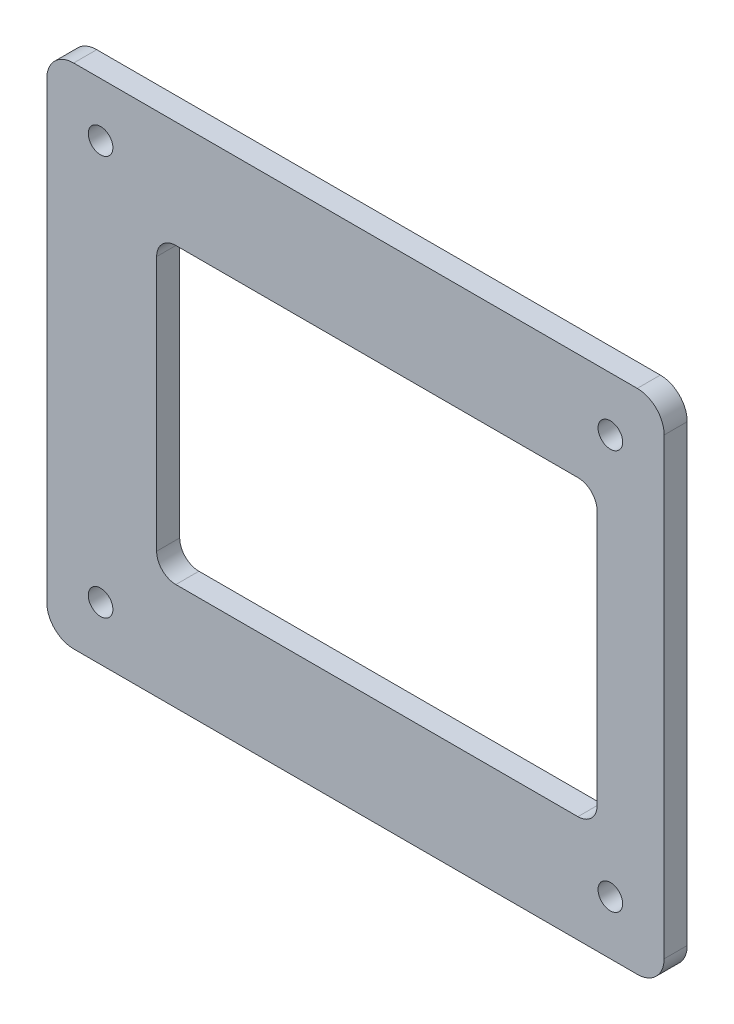
ISO-10303-21;
HEADER;
FILE_DESCRIPTION(('STEP AP214'),'2;1');
FILE_NAME('part.step','',(''),(''),'','','');
FILE_SCHEMA(('AUTOMOTIVE_DESIGN { 1 0 10303 214 1 1 1 1 }'));
ENDSEC;
DATA;
#1=APPLICATION_CONTEXT('core data for automotive mechanical design processes');
#2=APPLICATION_PROTOCOL_DEFINITION('international standard','automotive_design',2000,#1);
#3=PRODUCT_CONTEXT('',#1,'mechanical');
#4=PRODUCT('Part','Part','',(#3));
#5=PRODUCT_RELATED_PRODUCT_CATEGORY('part','',(#4));
#6=PRODUCT_DEFINITION_FORMATION('','',#4);
#7=PRODUCT_DEFINITION_CONTEXT('part definition',#1,'design');
#8=PRODUCT_DEFINITION('design','',#6,#7);
#9=PRODUCT_DEFINITION_SHAPE('','',#8);
#10=(LENGTH_UNIT() NAMED_UNIT(*) SI_UNIT(.MILLI.,.METRE.));
#11=(NAMED_UNIT(*) PLANE_ANGLE_UNIT() SI_UNIT($,.RADIAN.));
#12=(NAMED_UNIT(*) SI_UNIT($,.STERADIAN.) SOLID_ANGLE_UNIT());
#13=UNCERTAINTY_MEASURE_WITH_UNIT(LENGTH_MEASURE(1.E-05),#10,'distance_accuracy_value','');
#14=(GEOMETRIC_REPRESENTATION_CONTEXT(3) GLOBAL_UNCERTAINTY_ASSIGNED_CONTEXT((#13)) GLOBAL_UNIT_ASSIGNED_CONTEXT((#10,
#11,#12)) REPRESENTATION_CONTEXT('',''));
#15=CARTESIAN_POINT('',(0.,0.,0.));
#16=DIRECTION('',(0.,0.,1.));
#17=DIRECTION('',(1.,0.,0.));
#18=AXIS2_PLACEMENT_3D('',#15,#16,#17);
#19=CARTESIAN_POINT('',(0.,0.,3.));
#20=DIRECTION('',(1.,0.,0.));
#21=DIRECTION('',(0.,0.,-1.));
#22=AXIS2_PLACEMENT_3D('',#19,#20,#21);
#23=PLANE('',#22);
#24=DIRECTION('',(0.,-1.,0.));
#25=VECTOR('',#24,1.);
#26=CARTESIAN_POINT('',(0.,0.,0.));
#27=LINE('',#26,#25);
#28=CARTESIAN_POINT('',(0.,62.5,0.));
#29=VERTEX_POINT('',#28);
#30=CARTESIAN_POINT('',(0.,3.5,0.));
#31=VERTEX_POINT('',#30);
#32=EDGE_CURVE('E174',#29,#31,#27,.T.);
#33=ORIENTED_EDGE('',*,*,#32,.T.);
#34=DIRECTION('',(0.,0.,-1.));
#35=VECTOR('',#34,1.);
#36=CARTESIAN_POINT('',(0.,3.5,3.));
#37=LINE('',#36,#35);
#38=CARTESIAN_POINT('',(0.,3.5,3.));
#39=VERTEX_POINT('',#38);
#40=EDGE_CURVE('E152',#31,#39,#37,.F.);
#41=ORIENTED_EDGE('',*,*,#40,.T.);
#42=DIRECTION('',(0.,-1.,0.));
#43=VECTOR('',#42,1.);
#44=CARTESIAN_POINT('',(0.,0.,3.));
#45=LINE('',#44,#43);
#46=CARTESIAN_POINT('',(0.,62.5,3.));
#47=VERTEX_POINT('',#46);
#48=EDGE_CURVE('E185',#47,#39,#45,.T.);
#49=ORIENTED_EDGE('',*,*,#48,.F.);
#50=DIRECTION('',(0.,0.,-1.));
#51=VECTOR('',#50,1.);
#52=CARTESIAN_POINT('',(0.,62.5,3.));
#53=LINE('',#52,#51);
#54=EDGE_CURVE('E157',#47,#29,#53,.T.);
#55=ORIENTED_EDGE('',*,*,#54,.T.);
#56=EDGE_LOOP('',(#33,#41,#49,#55));
#57=FACE_BOUND('',#56,.T.);
#58=ADVANCED_FACE('F33',(#57),#23,.F.);
#59=CARTESIAN_POINT('',(0.,0.,3.));
#60=DIRECTION('',(0.,1.,0.));
#61=DIRECTION('',(0.,0.,1.));
#62=AXIS2_PLACEMENT_3D('',#59,#60,#61);
#63=PLANE('',#62);
#64=DIRECTION('',(1.,0.,0.));
#65=VECTOR('',#64,1.);
#66=CARTESIAN_POINT('',(0.,0.,3.));
#67=LINE('',#66,#65);
#68=CARTESIAN_POINT('',(3.5,0.,3.));
#69=VERTEX_POINT('',#68);
#70=CARTESIAN_POINT('',(76.8,0.,3.));
#71=VERTEX_POINT('',#70);
#72=EDGE_CURVE('E167',#69,#71,#67,.T.);
#73=ORIENTED_EDGE('',*,*,#72,.F.);
#74=DIRECTION('',(0.,0.,-1.));
#75=VECTOR('',#74,1.);
#76=CARTESIAN_POINT('',(3.5,0.,3.));
#77=LINE('',#76,#75);
#78=CARTESIAN_POINT('',(3.5,0.,0.));
#79=VERTEX_POINT('',#78);
#80=EDGE_CURVE('E151',#69,#79,#77,.T.);
#81=ORIENTED_EDGE('',*,*,#80,.T.);
#82=DIRECTION('',(1.,0.,0.));
#83=VECTOR('',#82,1.);
#84=CARTESIAN_POINT('',(0.,0.,0.));
#85=LINE('',#84,#83);
#86=CARTESIAN_POINT('',(76.8,0.,0.));
#87=VERTEX_POINT('',#86);
#88=EDGE_CURVE('E164',#79,#87,#85,.T.);
#89=ORIENTED_EDGE('',*,*,#88,.T.);
#90=DIRECTION('',(0.,0.,-1.));
#91=VECTOR('',#90,1.);
#92=CARTESIAN_POINT('',(76.8,0.,3.));
#93=LINE('',#92,#91);
#94=EDGE_CURVE('E169',#87,#71,#93,.F.);
#95=ORIENTED_EDGE('',*,*,#94,.T.);
#96=EDGE_LOOP('',(#73,#81,#89,#95));
#97=FACE_BOUND('',#96,.T.);
#98=ADVANCED_FACE('F163',(#97),#63,.F.);
#99=CARTESIAN_POINT('',(80.3,0.,3.));
#100=DIRECTION('',(-1.,0.,0.));
#101=DIRECTION('',(0.,0.,1.));
#102=AXIS2_PLACEMENT_3D('',#99,#100,#101);
#103=PLANE('',#102);
#104=DIRECTION('',(0.,1.,0.));
#105=VECTOR('',#104,1.);
#106=CARTESIAN_POINT('',(80.3,0.,3.));
#107=LINE('',#106,#105);
#108=CARTESIAN_POINT('',(80.3,3.5,3.));
#109=VERTEX_POINT('',#108);
#110=CARTESIAN_POINT('',(80.3,62.5,3.));
#111=VERTEX_POINT('',#110);
#112=EDGE_CURVE('E307',#109,#111,#107,.T.);
#113=ORIENTED_EDGE('',*,*,#112,.F.);
#114=DIRECTION('',(0.,0.,-1.));
#115=VECTOR('',#114,1.);
#116=CARTESIAN_POINT('',(80.3,3.5,3.));
#117=LINE('',#116,#115);
#118=CARTESIAN_POINT('',(80.3,3.5,0.));
#119=VERTEX_POINT('',#118);
#120=EDGE_CURVE('E205',#109,#119,#117,.T.);
#121=ORIENTED_EDGE('',*,*,#120,.T.);
#122=DIRECTION('',(0.,1.,0.));
#123=VECTOR('',#122,1.);
#124=CARTESIAN_POINT('',(80.3,0.,0.));
#125=LINE('',#124,#123);
#126=CARTESIAN_POINT('',(80.3,62.5,0.));
#127=VERTEX_POINT('',#126);
#128=EDGE_CURVE('E173',#119,#127,#125,.T.);
#129=ORIENTED_EDGE('',*,*,#128,.T.);
#130=DIRECTION('',(0.,0.,-1.));
#131=VECTOR('',#130,1.);
#132=CARTESIAN_POINT('',(80.3,62.5,3.));
#133=LINE('',#132,#131);
#134=EDGE_CURVE('E203',#127,#111,#133,.F.);
#135=ORIENTED_EDGE('',*,*,#134,.T.);
#136=EDGE_LOOP('',(#113,#121,#129,#135));
#137=FACE_BOUND('',#136,.T.);
#138=ADVANCED_FACE('F329',(#137),#103,.F.);
#139=CARTESIAN_POINT('',(0.,66.,3.));
#140=DIRECTION('',(0.,-1.,0.));
#141=DIRECTION('',(0.,0.,-1.));
#142=AXIS2_PLACEMENT_3D('',#139,#140,#141);
#143=PLANE('',#142);
#144=DIRECTION('',(-1.,0.,0.));
#145=VECTOR('',#144,1.);
#146=CARTESIAN_POINT('',(0.,66.,3.));
#147=LINE('',#146,#145);
#148=CARTESIAN_POINT('',(76.8,66.,3.));
#149=VERTEX_POINT('',#148);
#150=CARTESIAN_POINT('',(3.5,66.,3.));
#151=VERTEX_POINT('',#150);
#152=EDGE_CURVE('E186',#149,#151,#147,.T.);
#153=ORIENTED_EDGE('',*,*,#152,.F.);
#154=DIRECTION('',(0.,0.,-1.));
#155=VECTOR('',#154,1.);
#156=CARTESIAN_POINT('',(76.8,66.,3.));
#157=LINE('',#156,#155);
#158=CARTESIAN_POINT('',(76.8,66.,0.));
#159=VERTEX_POINT('',#158);
#160=EDGE_CURVE('E210',#149,#159,#157,.T.);
#161=ORIENTED_EDGE('',*,*,#160,.T.);
#162=DIRECTION('',(-1.,0.,0.));
#163=VECTOR('',#162,1.);
#164=CARTESIAN_POINT('',(0.,66.,0.));
#165=LINE('',#164,#163);
#166=CARTESIAN_POINT('',(3.5,66.,0.));
#167=VERTEX_POINT('',#166);
#168=EDGE_CURVE('E177',#159,#167,#165,.T.);
#169=ORIENTED_EDGE('',*,*,#168,.T.);
#170=DIRECTION('',(0.,0.,-1.));
#171=VECTOR('',#170,1.);
#172=CARTESIAN_POINT('',(3.5,66.,3.));
#173=LINE('',#172,#171);
#174=EDGE_CURVE('E208',#167,#151,#173,.F.);
#175=ORIENTED_EDGE('',*,*,#174,.T.);
#176=EDGE_LOOP('',(#153,#161,#169,#175));
#177=FACE_BOUND('',#176,.T.);
#178=ADVANCED_FACE('F323',(#177),#143,.F.);
#179=CARTESIAN_POINT('',(0.,0.,3.));
#180=DIRECTION('',(0.,0.,-1.));
#181=DIRECTION('',(-1.,0.,0.));
#182=AXIS2_PLACEMENT_3D('',#179,#180,#181);
#183=PLANE('',#182);
#184=DIRECTION('',(1.,0.,0.));
#185=VECTOR('',#184,1.);
#186=CARTESIAN_POINT('',(14.29,13.9,3.));
#187=LINE('',#186,#185);
#188=CARTESIAN_POINT('',(16.79,13.9,3.));
#189=VERTEX_POINT('',#188);
#190=CARTESIAN_POINT('',(69.08,13.9,3.));
#191=VERTEX_POINT('',#190);
#192=EDGE_CURVE('E277',#189,#191,#187,.T.);
#193=ORIENTED_EDGE('',*,*,#192,.F.);
#194=CARTESIAN_POINT('',(16.79,16.4,3.));
#195=DIRECTION('',(0.,0.,-1.));
#196=DIRECTION('',(-1.,0.,0.));
#197=AXIS2_PLACEMENT_3D('',#194,#195,#196);
#198=CIRCLE('',#197,2.5);
#199=CARTESIAN_POINT('',(14.29,16.4,3.));
#200=VERTEX_POINT('',#199);
#201=EDGE_CURVE('E232',#189,#200,#198,.T.);
#202=ORIENTED_EDGE('',*,*,#201,.T.);
#203=DIRECTION('',(0.,-1.,0.));
#204=VECTOR('',#203,1.);
#205=CARTESIAN_POINT('',(14.29,13.9,3.));
#206=LINE('',#205,#204);
#207=CARTESIAN_POINT('',(14.29,49.59,3.));
#208=VERTEX_POINT('',#207);
#209=EDGE_CURVE('E250',#208,#200,#206,.T.);
#210=ORIENTED_EDGE('',*,*,#209,.F.);
#211=CARTESIAN_POINT('',(16.79,49.59,3.));
#212=DIRECTION('',(0.,0.,-1.));
#213=DIRECTION('',(-1.,0.,0.));
#214=AXIS2_PLACEMENT_3D('',#211,#212,#213);
#215=CIRCLE('',#214,2.5);
#216=CARTESIAN_POINT('',(16.79,52.09,3.));
#217=VERTEX_POINT('',#216);
#218=EDGE_CURVE('E41',#208,#217,#215,.T.);
#219=ORIENTED_EDGE('',*,*,#218,.T.);
#220=DIRECTION('',(-1.,0.,0.));
#221=VECTOR('',#220,1.);
#222=CARTESIAN_POINT('',(14.29,52.09,3.));
#223=LINE('',#222,#221);
#224=CARTESIAN_POINT('',(69.08,52.09,3.));
#225=VERTEX_POINT('',#224);
#226=EDGE_CURVE('E248',#225,#217,#223,.T.);
#227=ORIENTED_EDGE('',*,*,#226,.F.);
#228=CARTESIAN_POINT('',(69.08,49.59,3.));
#229=DIRECTION('',(0.,0.,-1.));
#230=DIRECTION('',(-1.,0.,0.));
#231=AXIS2_PLACEMENT_3D('',#228,#229,#230);
#232=CIRCLE('',#231,2.5);
#233=CARTESIAN_POINT('',(71.58,49.59,3.));
#234=VERTEX_POINT('',#233);
#235=EDGE_CURVE('E240',#225,#234,#232,.T.);
#236=ORIENTED_EDGE('',*,*,#235,.T.);
#237=DIRECTION('',(0.,1.,0.));
#238=VECTOR('',#237,1.);
#239=CARTESIAN_POINT('',(71.58,13.9,3.));
#240=LINE('',#239,#238);
#241=CARTESIAN_POINT('',(71.58,16.4,3.));
#242=VERTEX_POINT('',#241);
#243=EDGE_CURVE('E256',#242,#234,#240,.T.);
#244=ORIENTED_EDGE('',*,*,#243,.F.);
#245=CARTESIAN_POINT('',(69.08,16.4,3.));
#246=DIRECTION('',(0.,0.,-1.));
#247=DIRECTION('',(-1.,0.,0.));
#248=AXIS2_PLACEMENT_3D('',#245,#246,#247);
#249=CIRCLE('',#248,2.5);
#250=EDGE_CURVE('E236',#242,#191,#249,.T.);
#251=ORIENTED_EDGE('',*,*,#250,.T.);
#252=EDGE_LOOP('',(#193,#202,#210,#219,#227,#236,#244,#251));
#253=FACE_BOUND('',#252,.T.);
#254=CARTESIAN_POINT('',(7.,59.,3.));
#255=DIRECTION('',(0.,0.,1.));
#256=DIRECTION('',(1.,0.,0.));
#257=AXIS2_PLACEMENT_3D('',#254,#255,#256);
#258=CIRCLE('',#257,1.59999999999999);
#259=CARTESIAN_POINT('',(8.59999999999999,59.,3.));
#260=VERTEX_POINT('',#259);
#261=EDGE_CURVE('E275',#260,#260,#258,.T.);
#262=ORIENTED_EDGE('',*,*,#261,.F.);
#263=EDGE_LOOP('',(#262));
#264=FACE_BOUND('',#263,.T.);
#265=CARTESIAN_POINT('',(73.3,59.,3.));
#266=DIRECTION('',(0.,0.,1.));
#267=DIRECTION('',(1.,0.,0.));
#268=AXIS2_PLACEMENT_3D('',#265,#266,#267);
#269=CIRCLE('',#268,1.59999999999999);
#270=CARTESIAN_POINT('',(74.9,59.,3.));
#271=VERTEX_POINT('',#270);
#272=EDGE_CURVE('E287',#271,#271,#269,.T.);
#273=ORIENTED_EDGE('',*,*,#272,.F.);
#274=EDGE_LOOP('',(#273));
#275=FACE_BOUND('',#274,.T.);
#276=CARTESIAN_POINT('',(73.3,7.,3.));
#277=DIRECTION('',(0.,0.,1.));
#278=DIRECTION('',(1.,0.,0.));
#279=AXIS2_PLACEMENT_3D('',#276,#277,#278);
#280=CIRCLE('',#279,1.59999999999999);
#281=CARTESIAN_POINT('',(74.9,7.,3.));
#282=VERTEX_POINT('',#281);
#283=EDGE_CURVE('E293',#282,#282,#280,.T.);
#284=ORIENTED_EDGE('',*,*,#283,.F.);
#285=EDGE_LOOP('',(#284));
#286=FACE_BOUND('',#285,.T.);
#287=CARTESIAN_POINT('',(7.,7.,3.));
#288=DIRECTION('',(0.,0.,1.));
#289=DIRECTION('',(1.,0.,0.));
#290=AXIS2_PLACEMENT_3D('',#287,#288,#289);
#291=CIRCLE('',#290,1.59999999999999);
#292=CARTESIAN_POINT('',(8.59999999999999,7.,3.));
#293=VERTEX_POINT('',#292);
#294=EDGE_CURVE('E299',#293,#293,#291,.T.);
#295=ORIENTED_EDGE('',*,*,#294,.F.);
#296=EDGE_LOOP('',(#295));
#297=FACE_BOUND('',#296,.T.);
#298=ORIENTED_EDGE('',*,*,#48,.T.);
#299=CARTESIAN_POINT('',(3.5,3.5,3.));
#300=DIRECTION('',(0.,0.,-1.));
#301=DIRECTION('',(-1.,0.,0.));
#302=AXIS2_PLACEMENT_3D('',#299,#300,#301);
#303=CIRCLE('',#302,3.5);
#304=EDGE_CURVE('E201',#39,#69,#303,.F.);
#305=ORIENTED_EDGE('',*,*,#304,.T.);
#306=ORIENTED_EDGE('',*,*,#72,.T.);
#307=CARTESIAN_POINT('',(76.8,3.5,3.));
#308=DIRECTION('',(0.,0.,-1.));
#309=DIRECTION('',(-1.,0.,0.));
#310=AXIS2_PLACEMENT_3D('',#307,#308,#309);
#311=CIRCLE('',#310,3.5);
#312=EDGE_CURVE('E199',#71,#109,#311,.F.);
#313=ORIENTED_EDGE('',*,*,#312,.T.);
#314=ORIENTED_EDGE('',*,*,#112,.T.);
#315=CARTESIAN_POINT('',(76.8,62.5,3.));
#316=DIRECTION('',(0.,0.,-1.));
#317=DIRECTION('',(-1.,0.,0.));
#318=AXIS2_PLACEMENT_3D('',#315,#316,#317);
#319=CIRCLE('',#318,3.5);
#320=EDGE_CURVE('E197',#111,#149,#319,.F.);
#321=ORIENTED_EDGE('',*,*,#320,.T.);
#322=ORIENTED_EDGE('',*,*,#152,.T.);
#323=CARTESIAN_POINT('',(3.5,62.5,3.));
#324=DIRECTION('',(0.,0.,-1.));
#325=DIRECTION('',(-1.,0.,0.));
#326=AXIS2_PLACEMENT_3D('',#323,#324,#325);
#327=CIRCLE('',#326,3.5);
#328=EDGE_CURVE('E195',#151,#47,#327,.F.);
#329=ORIENTED_EDGE('',*,*,#328,.T.);
#330=EDGE_LOOP('',(#298,#305,#306,#313,#314,#321,#322,#329));
#331=FACE_BOUND('',#330,.T.);
#332=ADVANCED_FACE('F246',(#253,#264,#275,#286,#297,#331),#183,.F.);
#333=CARTESIAN_POINT('',(0.,0.,0.));
#334=DIRECTION('',(0.,0.,-1.));
#335=DIRECTION('',(-1.,0.,0.));
#336=AXIS2_PLACEMENT_3D('',#333,#334,#335);
#337=PLANE('',#336);
#338=DIRECTION('',(-1.,0.,0.));
#339=VECTOR('',#338,1.);
#340=CARTESIAN_POINT('',(14.29,52.09,0.));
#341=LINE('',#340,#339);
#342=CARTESIAN_POINT('',(69.08,52.09,0.));
#343=VERTEX_POINT('',#342);
#344=CARTESIAN_POINT('',(16.79,52.09,0.));
#345=VERTEX_POINT('',#344);
#346=EDGE_CURVE('E263',#343,#345,#341,.T.);
#347=ORIENTED_EDGE('',*,*,#346,.T.);
#348=CARTESIAN_POINT('',(16.79,49.59,0.));
#349=DIRECTION('',(0.,0.,-1.));
#350=DIRECTION('',(-1.,0.,0.));
#351=AXIS2_PLACEMENT_3D('',#348,#349,#350);
#352=CIRCLE('',#351,2.5);
#353=CARTESIAN_POINT('',(14.29,49.59,0.));
#354=VERTEX_POINT('',#353);
#355=EDGE_CURVE('E11',#345,#354,#352,.F.);
#356=ORIENTED_EDGE('',*,*,#355,.T.);
#357=DIRECTION('',(0.,-1.,0.));
#358=VECTOR('',#357,1.);
#359=CARTESIAN_POINT('',(14.29,13.9,0.));
#360=LINE('',#359,#358);
#361=CARTESIAN_POINT('',(14.29,16.4,0.));
#362=VERTEX_POINT('',#361);
#363=EDGE_CURVE('E255',#354,#362,#360,.T.);
#364=ORIENTED_EDGE('',*,*,#363,.T.);
#365=CARTESIAN_POINT('',(16.79,16.4,0.));
#366=DIRECTION('',(0.,0.,-1.));
#367=DIRECTION('',(-1.,0.,0.));
#368=AXIS2_PLACEMENT_3D('',#365,#366,#367);
#369=CIRCLE('',#368,2.5);
#370=CARTESIAN_POINT('',(16.79,13.9,0.));
#371=VERTEX_POINT('',#370);
#372=EDGE_CURVE('E234',#362,#371,#369,.F.);
#373=ORIENTED_EDGE('',*,*,#372,.T.);
#374=DIRECTION('',(1.,0.,0.));
#375=VECTOR('',#374,1.);
#376=CARTESIAN_POINT('',(14.29,13.9,0.));
#377=LINE('',#376,#375);
#378=CARTESIAN_POINT('',(69.08,13.9,0.));
#379=VERTEX_POINT('',#378);
#380=EDGE_CURVE('E267',#371,#379,#377,.T.);
#381=ORIENTED_EDGE('',*,*,#380,.T.);
#382=CARTESIAN_POINT('',(69.08,16.4,0.));
#383=DIRECTION('',(0.,0.,-1.));
#384=DIRECTION('',(-1.,0.,0.));
#385=AXIS2_PLACEMENT_3D('',#382,#383,#384);
#386=CIRCLE('',#385,2.5);
#387=CARTESIAN_POINT('',(71.58,16.4,0.));
#388=VERTEX_POINT('',#387);
#389=EDGE_CURVE('E238',#379,#388,#386,.F.);
#390=ORIENTED_EDGE('',*,*,#389,.T.);
#391=DIRECTION('',(0.,1.,0.));
#392=VECTOR('',#391,1.);
#393=CARTESIAN_POINT('',(71.58,13.9,0.));
#394=LINE('',#393,#392);
#395=CARTESIAN_POINT('',(71.58,49.59,0.));
#396=VERTEX_POINT('',#395);
#397=EDGE_CURVE('E270',#388,#396,#394,.T.);
#398=ORIENTED_EDGE('',*,*,#397,.T.);
#399=CARTESIAN_POINT('',(69.08,49.59,0.));
#400=DIRECTION('',(0.,0.,-1.));
#401=DIRECTION('',(-1.,0.,0.));
#402=AXIS2_PLACEMENT_3D('',#399,#400,#401);
#403=CIRCLE('',#402,2.5);
#404=EDGE_CURVE('E55',#396,#343,#403,.F.);
#405=ORIENTED_EDGE('',*,*,#404,.T.);
#406=EDGE_LOOP('',(#347,#356,#364,#373,#381,#390,#398,#405));
#407=FACE_BOUND('',#406,.T.);
#408=CARTESIAN_POINT('',(7.,59.,0.));
#409=DIRECTION('',(0.,0.,1.));
#410=DIRECTION('',(1.,0.,0.));
#411=AXIS2_PLACEMENT_3D('',#408,#409,#410);
#412=CIRCLE('',#411,1.6);
#413=CARTESIAN_POINT('',(8.6,59.,0.));
#414=VERTEX_POINT('',#413);
#415=EDGE_CURVE('E284',#414,#414,#412,.T.);
#416=ORIENTED_EDGE('',*,*,#415,.T.);
#417=EDGE_LOOP('',(#416));
#418=FACE_BOUND('',#417,.T.);
#419=CARTESIAN_POINT('',(73.3,59.,0.));
#420=DIRECTION('',(0.,0.,1.));
#421=DIRECTION('',(1.,0.,0.));
#422=AXIS2_PLACEMENT_3D('',#419,#420,#421);
#423=CIRCLE('',#422,1.6);
#424=CARTESIAN_POINT('',(74.9,59.,0.));
#425=VERTEX_POINT('',#424);
#426=EDGE_CURVE('E290',#425,#425,#423,.T.);
#427=ORIENTED_EDGE('',*,*,#426,.T.);
#428=EDGE_LOOP('',(#427));
#429=FACE_BOUND('',#428,.T.);
#430=CARTESIAN_POINT('',(73.3,7.,0.));
#431=DIRECTION('',(0.,0.,1.));
#432=DIRECTION('',(1.,0.,0.));
#433=AXIS2_PLACEMENT_3D('',#430,#431,#432);
#434=CIRCLE('',#433,1.6);
#435=CARTESIAN_POINT('',(74.9,7.,0.));
#436=VERTEX_POINT('',#435);
#437=EDGE_CURVE('E296',#436,#436,#434,.T.);
#438=ORIENTED_EDGE('',*,*,#437,.T.);
#439=EDGE_LOOP('',(#438));
#440=FACE_BOUND('',#439,.T.);
#441=CARTESIAN_POINT('',(7.,7.,0.));
#442=DIRECTION('',(0.,0.,1.));
#443=DIRECTION('',(1.,0.,0.));
#444=AXIS2_PLACEMENT_3D('',#441,#442,#443);
#445=CIRCLE('',#444,1.6);
#446=CARTESIAN_POINT('',(8.6,7.,0.));
#447=VERTEX_POINT('',#446);
#448=EDGE_CURVE('E179',#447,#447,#445,.T.);
#449=ORIENTED_EDGE('',*,*,#448,.T.);
#450=EDGE_LOOP('',(#449));
#451=FACE_BOUND('',#450,.T.);
#452=ORIENTED_EDGE('',*,*,#88,.F.);
#453=CARTESIAN_POINT('',(3.5,3.5,0.));
#454=DIRECTION('',(0.,0.,-1.));
#455=DIRECTION('',(-1.,0.,0.));
#456=AXIS2_PLACEMENT_3D('',#453,#454,#455);
#457=CIRCLE('',#456,3.5);
#458=EDGE_CURVE('E147',#79,#31,#457,.T.);
#459=ORIENTED_EDGE('',*,*,#458,.T.);
#460=ORIENTED_EDGE('',*,*,#32,.F.);
#461=CARTESIAN_POINT('',(3.5,62.5,0.));
#462=DIRECTION('',(0.,0.,-1.));
#463=DIRECTION('',(-1.,0.,0.));
#464=AXIS2_PLACEMENT_3D('',#461,#462,#463);
#465=CIRCLE('',#464,3.5);
#466=EDGE_CURVE('E168',#29,#167,#465,.T.);
#467=ORIENTED_EDGE('',*,*,#466,.T.);
#468=ORIENTED_EDGE('',*,*,#168,.F.);
#469=CARTESIAN_POINT('',(76.8,62.5,0.));
#470=DIRECTION('',(0.,0.,-1.));
#471=DIRECTION('',(-1.,0.,0.));
#472=AXIS2_PLACEMENT_3D('',#469,#470,#471);
#473=CIRCLE('',#472,3.5);
#474=EDGE_CURVE('E189',#159,#127,#473,.T.);
#475=ORIENTED_EDGE('',*,*,#474,.T.);
#476=ORIENTED_EDGE('',*,*,#128,.F.);
#477=CARTESIAN_POINT('',(76.8,3.5,0.));
#478=DIRECTION('',(0.,0.,-1.));
#479=DIRECTION('',(-1.,0.,0.));
#480=AXIS2_PLACEMENT_3D('',#477,#478,#479);
#481=CIRCLE('',#480,3.5);
#482=EDGE_CURVE('E158',#119,#87,#481,.T.);
#483=ORIENTED_EDGE('',*,*,#482,.T.);
#484=EDGE_LOOP('',(#452,#459,#460,#467,#468,#475,#476,#483));
#485=FACE_BOUND('',#484,.T.);
#486=ADVANCED_FACE('F171',(#407,#418,#429,#440,#451,#485),#337,.T.);
#487=CARTESIAN_POINT('',(7.,7.,3.));
#488=DIRECTION('',(0.,0.,1.));
#489=DIRECTION('',(1.,0.,0.));
#490=AXIS2_PLACEMENT_3D('',#487,#488,#489);
#491=CYLINDRICAL_SURFACE('',#490,1.59999999999999);
#492=ORIENTED_EDGE('',*,*,#448,.F.);
#493=EDGE_LOOP('',(#492));
#494=FACE_BOUND('',#493,.T.);
#495=ORIENTED_EDGE('',*,*,#294,.T.);
#496=EDGE_LOOP('',(#495));
#497=FACE_BOUND('',#496,.T.);
#498=ADVANCED_FACE('F356',(#494,#497),#491,.F.);
#499=CARTESIAN_POINT('',(73.3,7.,3.));
#500=DIRECTION('',(0.,0.,1.));
#501=DIRECTION('',(1.,0.,0.));
#502=AXIS2_PLACEMENT_3D('',#499,#500,#501);
#503=CYLINDRICAL_SURFACE('',#502,1.6);
#504=ORIENTED_EDGE('',*,*,#437,.F.);
#505=EDGE_LOOP('',(#504));
#506=FACE_BOUND('',#505,.T.);
#507=ORIENTED_EDGE('',*,*,#283,.T.);
#508=EDGE_LOOP('',(#507));
#509=FACE_BOUND('',#508,.T.);
#510=ADVANCED_FACE('F361',(#506,#509),#503,.F.);
#511=CARTESIAN_POINT('',(73.3,59.,3.));
#512=DIRECTION('',(0.,0.,1.));
#513=DIRECTION('',(1.,0.,0.));
#514=AXIS2_PLACEMENT_3D('',#511,#512,#513);
#515=CYLINDRICAL_SURFACE('',#514,1.6);
#516=ORIENTED_EDGE('',*,*,#426,.F.);
#517=EDGE_LOOP('',(#516));
#518=FACE_BOUND('',#517,.T.);
#519=ORIENTED_EDGE('',*,*,#272,.T.);
#520=EDGE_LOOP('',(#519));
#521=FACE_BOUND('',#520,.T.);
#522=ADVANCED_FACE('F365',(#518,#521),#515,.F.);
#523=CARTESIAN_POINT('',(7.,59.,3.));
#524=DIRECTION('',(0.,0.,1.));
#525=DIRECTION('',(1.,0.,0.));
#526=AXIS2_PLACEMENT_3D('',#523,#524,#525);
#527=CYLINDRICAL_SURFACE('',#526,1.59999999999999);
#528=ORIENTED_EDGE('',*,*,#415,.F.);
#529=EDGE_LOOP('',(#528));
#530=FACE_BOUND('',#529,.T.);
#531=ORIENTED_EDGE('',*,*,#261,.T.);
#532=EDGE_LOOP('',(#531));
#533=FACE_BOUND('',#532,.T.);
#534=ADVANCED_FACE('F369',(#530,#533),#527,.F.);
#535=CARTESIAN_POINT('',(14.29,13.9,0.));
#536=DIRECTION('',(-1.,0.,0.));
#537=DIRECTION('',(0.,0.,1.));
#538=AXIS2_PLACEMENT_3D('',#535,#536,#537);
#539=PLANE('',#538);
#540=ORIENTED_EDGE('',*,*,#209,.T.);
#541=DIRECTION('',(0.,0.,1.));
#542=VECTOR('',#541,1.);
#543=CARTESIAN_POINT('',(14.29,16.4,0.));
#544=LINE('',#543,#542);
#545=EDGE_CURVE('E221',#200,#362,#544,.F.);
#546=ORIENTED_EDGE('',*,*,#545,.T.);
#547=ORIENTED_EDGE('',*,*,#363,.F.);
#548=DIRECTION('',(0.,0.,1.));
#549=VECTOR('',#548,1.);
#550=CARTESIAN_POINT('',(14.29,49.59,3.));
#551=LINE('',#550,#549);
#552=EDGE_CURVE('E218',#354,#208,#551,.T.);
#553=ORIENTED_EDGE('',*,*,#552,.T.);
#554=EDGE_LOOP('',(#540,#546,#547,#553));
#555=FACE_BOUND('',#554,.T.);
#556=ADVANCED_FACE('F265',(#555),#539,.F.);
#557=CARTESIAN_POINT('',(14.29,52.09,0.));
#558=DIRECTION('',(0.,1.,0.));
#559=DIRECTION('',(0.,0.,1.));
#560=AXIS2_PLACEMENT_3D('',#557,#558,#559);
#561=PLANE('',#560);
#562=ORIENTED_EDGE('',*,*,#346,.F.);
#563=DIRECTION('',(0.,0.,1.));
#564=VECTOR('',#563,1.);
#565=CARTESIAN_POINT('',(69.08,52.09,3.));
#566=LINE('',#565,#564);
#567=EDGE_CURVE('E229',#343,#225,#566,.T.);
#568=ORIENTED_EDGE('',*,*,#567,.T.);
#569=ORIENTED_EDGE('',*,*,#226,.T.);
#570=DIRECTION('',(0.,0.,1.));
#571=VECTOR('',#570,1.);
#572=CARTESIAN_POINT('',(16.79,52.09,0.));
#573=LINE('',#572,#571);
#574=EDGE_CURVE('E48',#217,#345,#573,.F.);
#575=ORIENTED_EDGE('',*,*,#574,.T.);
#576=EDGE_LOOP('',(#562,#568,#569,#575));
#577=FACE_BOUND('',#576,.T.);
#578=ADVANCED_FACE('F253',(#577),#561,.F.);
#579=CARTESIAN_POINT('',(71.58,13.9,0.));
#580=DIRECTION('',(1.,0.,0.));
#581=DIRECTION('',(0.,0.,-1.));
#582=AXIS2_PLACEMENT_3D('',#579,#580,#581);
#583=PLANE('',#582);
#584=ORIENTED_EDGE('',*,*,#397,.F.);
#585=DIRECTION('',(0.,0.,1.));
#586=VECTOR('',#585,1.);
#587=CARTESIAN_POINT('',(71.58,16.4,3.));
#588=LINE('',#587,#586);
#589=EDGE_CURVE('E225',#388,#242,#588,.T.);
#590=ORIENTED_EDGE('',*,*,#589,.T.);
#591=ORIENTED_EDGE('',*,*,#243,.T.);
#592=DIRECTION('',(0.,0.,1.));
#593=VECTOR('',#592,1.);
#594=CARTESIAN_POINT('',(71.58,49.59,0.));
#595=LINE('',#594,#593);
#596=EDGE_CURVE('E223',#234,#396,#595,.F.);
#597=ORIENTED_EDGE('',*,*,#596,.T.);
#598=EDGE_LOOP('',(#584,#590,#591,#597));
#599=FACE_BOUND('',#598,.T.);
#600=ADVANCED_FACE('F378',(#599),#583,.F.);
#601=CARTESIAN_POINT('',(14.29,13.9,0.));
#602=DIRECTION('',(0.,-1.,0.));
#603=DIRECTION('',(0.,0.,-1.));
#604=AXIS2_PLACEMENT_3D('',#601,#602,#603);
#605=PLANE('',#604);
#606=ORIENTED_EDGE('',*,*,#380,.F.);
#607=DIRECTION('',(0.,0.,1.));
#608=VECTOR('',#607,1.);
#609=CARTESIAN_POINT('',(16.79,13.9,3.));
#610=LINE('',#609,#608);
#611=EDGE_CURVE('E215',#371,#189,#610,.T.);
#612=ORIENTED_EDGE('',*,*,#611,.T.);
#613=ORIENTED_EDGE('',*,*,#192,.T.);
#614=DIRECTION('',(0.,0.,1.));
#615=VECTOR('',#614,1.);
#616=CARTESIAN_POINT('',(69.08,13.9,0.));
#617=LINE('',#616,#615);
#618=EDGE_CURVE('E213',#191,#379,#617,.F.);
#619=ORIENTED_EDGE('',*,*,#618,.T.);
#620=EDGE_LOOP('',(#606,#612,#613,#619));
#621=FACE_BOUND('',#620,.T.);
#622=ADVANCED_FACE('F341',(#621),#605,.F.);
#623=CARTESIAN_POINT('',(3.5,3.5,3.));
#624=DIRECTION('',(0.,0.,-1.));
#625=DIRECTION('',(-1.,0.,0.));
#626=AXIS2_PLACEMENT_3D('',#623,#624,#625);
#627=CYLINDRICAL_SURFACE('',#626,3.5);
#628=ORIENTED_EDGE('',*,*,#304,.F.);
#629=ORIENTED_EDGE('',*,*,#40,.F.);
#630=ORIENTED_EDGE('',*,*,#458,.F.);
#631=ORIENTED_EDGE('',*,*,#80,.F.);
#632=EDGE_LOOP('',(#628,#629,#630,#631));
#633=FACE_BOUND('',#632,.T.);
#634=ADVANCED_FACE('F150',(#633),#627,.T.);
#635=CARTESIAN_POINT('',(76.8,3.5,3.));
#636=DIRECTION('',(0.,0.,-1.));
#637=DIRECTION('',(-1.,0.,0.));
#638=AXIS2_PLACEMENT_3D('',#635,#636,#637);
#639=CYLINDRICAL_SURFACE('',#638,3.5);
#640=ORIENTED_EDGE('',*,*,#312,.F.);
#641=ORIENTED_EDGE('',*,*,#94,.F.);
#642=ORIENTED_EDGE('',*,*,#482,.F.);
#643=ORIENTED_EDGE('',*,*,#120,.F.);
#644=EDGE_LOOP('',(#640,#641,#642,#643));
#645=FACE_BOUND('',#644,.T.);
#646=ADVANCED_FACE('F333',(#645),#639,.T.);
#647=CARTESIAN_POINT('',(76.8,62.5,3.));
#648=DIRECTION('',(0.,0.,-1.));
#649=DIRECTION('',(-1.,0.,0.));
#650=AXIS2_PLACEMENT_3D('',#647,#648,#649);
#651=CYLINDRICAL_SURFACE('',#650,3.5);
#652=ORIENTED_EDGE('',*,*,#320,.F.);
#653=ORIENTED_EDGE('',*,*,#134,.F.);
#654=ORIENTED_EDGE('',*,*,#474,.F.);
#655=ORIENTED_EDGE('',*,*,#160,.F.);
#656=EDGE_LOOP('',(#652,#653,#654,#655));
#657=FACE_BOUND('',#656,.T.);
#658=ADVANCED_FACE('F325',(#657),#651,.T.);
#659=CARTESIAN_POINT('',(3.5,62.5,3.));
#660=DIRECTION('',(0.,0.,-1.));
#661=DIRECTION('',(-1.,0.,0.));
#662=AXIS2_PLACEMENT_3D('',#659,#660,#661);
#663=CYLINDRICAL_SURFACE('',#662,3.5);
#664=ORIENTED_EDGE('',*,*,#328,.F.);
#665=ORIENTED_EDGE('',*,*,#174,.F.);
#666=ORIENTED_EDGE('',*,*,#466,.F.);
#667=ORIENTED_EDGE('',*,*,#54,.F.);
#668=EDGE_LOOP('',(#664,#665,#666,#667));
#669=FACE_BOUND('',#668,.T.);
#670=ADVANCED_FACE('F320',(#669),#663,.T.);
#671=CARTESIAN_POINT('',(16.79,16.4,0.));
#672=DIRECTION('',(0.,0.,-1.));
#673=DIRECTION('',(-1.,0.,0.));
#674=AXIS2_PLACEMENT_3D('',#671,#672,#673);
#675=CYLINDRICAL_SURFACE('',#674,2.5);
#676=ORIENTED_EDGE('',*,*,#372,.F.);
#677=ORIENTED_EDGE('',*,*,#545,.F.);
#678=ORIENTED_EDGE('',*,*,#201,.F.);
#679=ORIENTED_EDGE('',*,*,#611,.F.);
#680=EDGE_LOOP('',(#676,#677,#678,#679));
#681=FACE_BOUND('',#680,.T.);
#682=ADVANCED_FACE('F424',(#681),#675,.F.);
#683=CARTESIAN_POINT('',(69.08,16.4,0.));
#684=DIRECTION('',(0.,0.,-1.));
#685=DIRECTION('',(-1.,0.,0.));
#686=AXIS2_PLACEMENT_3D('',#683,#684,#685);
#687=CYLINDRICAL_SURFACE('',#686,2.5);
#688=ORIENTED_EDGE('',*,*,#389,.F.);
#689=ORIENTED_EDGE('',*,*,#618,.F.);
#690=ORIENTED_EDGE('',*,*,#250,.F.);
#691=ORIENTED_EDGE('',*,*,#589,.F.);
#692=EDGE_LOOP('',(#688,#689,#690,#691));
#693=FACE_BOUND('',#692,.T.);
#694=ADVANCED_FACE('F496',(#693),#687,.F.);
#695=CARTESIAN_POINT('',(69.08,49.59,0.));
#696=DIRECTION('',(0.,0.,-1.));
#697=DIRECTION('',(-1.,0.,0.));
#698=AXIS2_PLACEMENT_3D('',#695,#696,#697);
#699=CYLINDRICAL_SURFACE('',#698,2.5);
#700=ORIENTED_EDGE('',*,*,#404,.F.);
#701=ORIENTED_EDGE('',*,*,#596,.F.);
#702=ORIENTED_EDGE('',*,*,#235,.F.);
#703=ORIENTED_EDGE('',*,*,#567,.F.);
#704=EDGE_LOOP('',(#700,#701,#702,#703));
#705=FACE_BOUND('',#704,.T.);
#706=ADVANCED_FACE('F503',(#705),#699,.F.);
#707=CARTESIAN_POINT('',(16.79,49.59,0.));
#708=DIRECTION('',(0.,0.,-1.));
#709=DIRECTION('',(-1.,0.,0.));
#710=AXIS2_PLACEMENT_3D('',#707,#708,#709);
#711=CYLINDRICAL_SURFACE('',#710,2.5);
#712=ORIENTED_EDGE('',*,*,#355,.F.);
#713=ORIENTED_EDGE('',*,*,#574,.F.);
#714=ORIENTED_EDGE('',*,*,#218,.F.);
#715=ORIENTED_EDGE('',*,*,#552,.F.);
#716=EDGE_LOOP('',(#712,#713,#714,#715));
#717=FACE_BOUND('',#716,.T.);
#718=ADVANCED_FACE('F35',(#717),#711,.F.);
#719=CLOSED_SHELL('',(#58,#98,#138,#178,#332,#486,#498,#510,#522,#534,#556,#578,#600,#622,#634,
#646,#658,#670,#682,#694,#706,#718));
#720=MANIFOLD_SOLID_BREP('B2',#719);
#721=ADVANCED_BREP_SHAPE_REPRESENTATION('',(#18,#720),#14);
#722=SHAPE_DEFINITION_REPRESENTATION(#9,#721);
ENDSEC;
END-ISO-10303-21;
